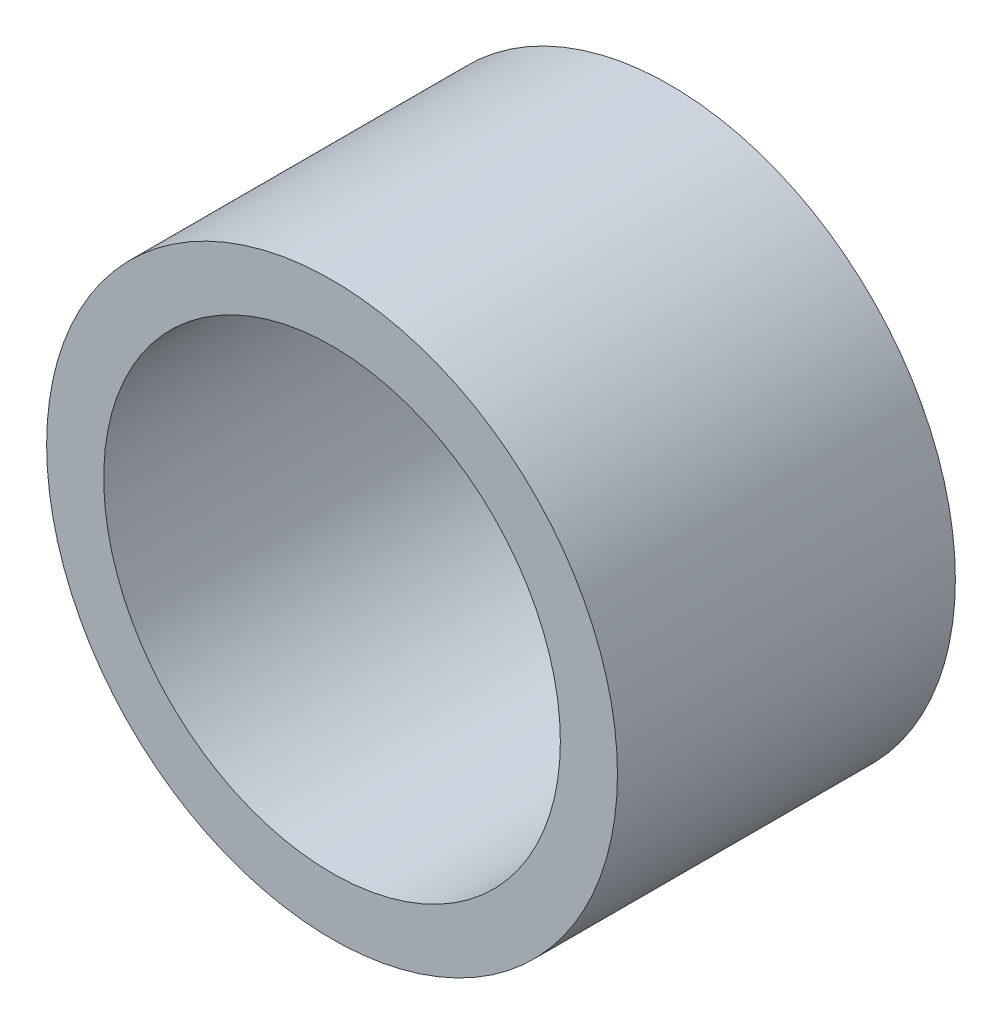
ISO-10303-21;
HEADER;
FILE_DESCRIPTION(('STEP AP214'),'2;1');
FILE_NAME('part.step','',(''),(''),'','','');
FILE_SCHEMA(('AUTOMOTIVE_DESIGN { 1 0 10303 214 1 1 1 1 }'));
ENDSEC;
DATA;
#1=APPLICATION_CONTEXT('core data for automotive mechanical design processes');
#2=APPLICATION_PROTOCOL_DEFINITION('international standard','automotive_design',2000,#1);
#3=PRODUCT_CONTEXT('',#1,'mechanical');
#4=PRODUCT('Part','Part','',(#3));
#5=PRODUCT_RELATED_PRODUCT_CATEGORY('part','',(#4));
#6=PRODUCT_DEFINITION_FORMATION('','',#4);
#7=PRODUCT_DEFINITION_CONTEXT('part definition',#1,'design');
#8=PRODUCT_DEFINITION('design','',#6,#7);
#9=PRODUCT_DEFINITION_SHAPE('','',#8);
#10=(LENGTH_UNIT() NAMED_UNIT(*) SI_UNIT(.MILLI.,.METRE.));
#11=(NAMED_UNIT(*) PLANE_ANGLE_UNIT() SI_UNIT($,.RADIAN.));
#12=(NAMED_UNIT(*) SI_UNIT($,.STERADIAN.) SOLID_ANGLE_UNIT());
#13=UNCERTAINTY_MEASURE_WITH_UNIT(LENGTH_MEASURE(1.E-05),#10,'distance_accuracy_value','');
#14=(GEOMETRIC_REPRESENTATION_CONTEXT(3) GLOBAL_UNCERTAINTY_ASSIGNED_CONTEXT((#13)) GLOBAL_UNIT_ASSIGNED_CONTEXT((#10,
#11,#12)) REPRESENTATION_CONTEXT('',''));
#15=CARTESIAN_POINT('',(0.,0.,0.));
#16=DIRECTION('',(0.,0.,1.));
#17=DIRECTION('',(1.,0.,0.));
#18=AXIS2_PLACEMENT_3D('',#15,#16,#17);
#19=CARTESIAN_POINT('',(0.,0.,4.699));
#20=DIRECTION('',(0.,0.,1.));
#21=DIRECTION('',(1.,0.,0.));
#22=AXIS2_PLACEMENT_3D('',#19,#20,#21);
#23=PLANE('',#22);
#24=CARTESIAN_POINT('',(0.,0.,4.699));
#25=DIRECTION('',(0.,0.,1.));
#26=DIRECTION('',(1.,0.,0.));
#27=AXIS2_PLACEMENT_3D('',#24,#25,#26);
#28=CIRCLE('',#27,3.96875);
#29=CARTESIAN_POINT('',(3.96875,0.,4.699));
#30=VERTEX_POINT('',#29);
#31=EDGE_CURVE('E10',#30,#30,#28,.T.);
#32=ORIENTED_EDGE('',*,*,#31,.T.);
#33=EDGE_LOOP('',(#32));
#34=FACE_BOUND('',#33,.T.);
#35=CARTESIAN_POINT('',(0.,0.,4.699));
#36=DIRECTION('',(0.,0.,1.));
#37=DIRECTION('',(1.,0.,0.));
#38=AXIS2_PLACEMENT_3D('',#35,#36,#37);
#39=CIRCLE('',#38,3.175);
#40=CARTESIAN_POINT('',(3.175,0.,4.699));
#41=VERTEX_POINT('',#40);
#42=EDGE_CURVE('E41',#41,#41,#39,.T.);
#43=ORIENTED_EDGE('',*,*,#42,.F.);
#44=EDGE_LOOP('',(#43));
#45=FACE_BOUND('',#44,.T.);
#46=ADVANCED_FACE('F30',(#34,#45),#23,.T.);
#47=CARTESIAN_POINT('',(0.,0.,0.));
#48=DIRECTION('',(0.,0.,1.));
#49=DIRECTION('',(1.,0.,0.));
#50=AXIS2_PLACEMENT_3D('',#47,#48,#49);
#51=PLANE('',#50);
#52=CARTESIAN_POINT('',(0.,0.,0.));
#53=DIRECTION('',(0.,0.,1.));
#54=DIRECTION('',(1.,0.,0.));
#55=AXIS2_PLACEMENT_3D('',#52,#53,#54);
#56=CIRCLE('',#55,3.96875);
#57=CARTESIAN_POINT('',(3.96875,0.,0.));
#58=VERTEX_POINT('',#57);
#59=EDGE_CURVE('E34',#58,#58,#56,.T.);
#60=ORIENTED_EDGE('',*,*,#59,.F.);
#61=EDGE_LOOP('',(#60));
#62=FACE_BOUND('',#61,.T.);
#63=CARTESIAN_POINT('',(0.,0.,0.));
#64=DIRECTION('',(0.,0.,1.));
#65=DIRECTION('',(1.,0.,0.));
#66=AXIS2_PLACEMENT_3D('',#63,#64,#65);
#67=CIRCLE('',#66,3.175);
#68=CARTESIAN_POINT('',(3.175,0.,0.));
#69=VERTEX_POINT('',#68);
#70=EDGE_CURVE('E43',#69,#69,#67,.T.);
#71=ORIENTED_EDGE('',*,*,#70,.T.);
#72=EDGE_LOOP('',(#71));
#73=FACE_BOUND('',#72,.T.);
#74=ADVANCED_FACE('F53',(#62,#73),#51,.F.);
#75=CARTESIAN_POINT('',(0.,0.,4.699));
#76=DIRECTION('',(0.,0.,-1.));
#77=DIRECTION('',(-1.,0.,0.));
#78=AXIS2_PLACEMENT_3D('',#75,#76,#77);
#79=CYLINDRICAL_SURFACE('',#78,3.96875);
#80=ORIENTED_EDGE('',*,*,#31,.F.);
#81=EDGE_LOOP('',(#80));
#82=FACE_BOUND('',#81,.T.);
#83=ORIENTED_EDGE('',*,*,#59,.T.);
#84=EDGE_LOOP('',(#83));
#85=FACE_BOUND('',#84,.T.);
#86=ADVANCED_FACE('F32',(#82,#85),#79,.T.);
#87=CARTESIAN_POINT('',(0.,0.,4.699));
#88=DIRECTION('',(0.,0.,-1.));
#89=DIRECTION('',(-1.,0.,0.));
#90=AXIS2_PLACEMENT_3D('',#87,#88,#89);
#91=CYLINDRICAL_SURFACE('',#90,3.175);
#92=ORIENTED_EDGE('',*,*,#42,.T.);
#93=EDGE_LOOP('',(#92));
#94=FACE_BOUND('',#93,.T.);
#95=ORIENTED_EDGE('',*,*,#70,.F.);
#96=EDGE_LOOP('',(#95));
#97=FACE_BOUND('',#96,.T.);
#98=ADVANCED_FACE('F49',(#94,#97),#91,.F.);
#99=CLOSED_SHELL('',(#46,#74,#86,#98));
#100=MANIFOLD_SOLID_BREP('B2',#99);
#101=ADVANCED_BREP_SHAPE_REPRESENTATION('',(#18,#100),#14);
#102=SHAPE_DEFINITION_REPRESENTATION(#9,#101);
ENDSEC;
END-ISO-10303-21;
